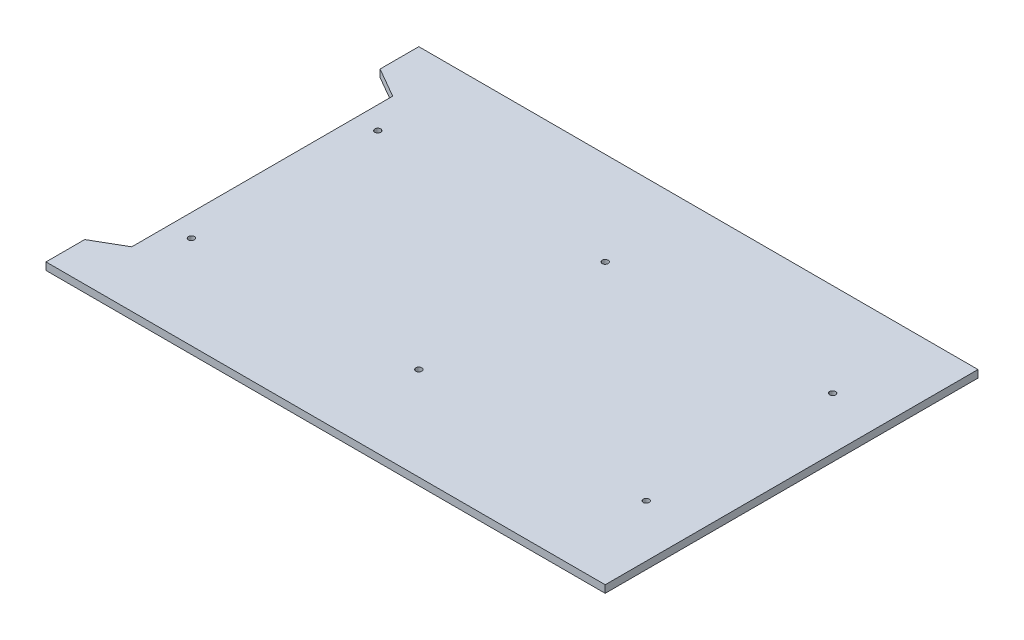
ISO-10303-21;
HEADER;
FILE_DESCRIPTION(('STEP AP214'),'2;1');
FILE_NAME('part.step','',(''),(''),'','','');
FILE_SCHEMA(('AUTOMOTIVE_DESIGN { 1 0 10303 214 1 1 1 1 }'));
ENDSEC;
DATA;
#1=APPLICATION_CONTEXT('core data for automotive mechanical design processes');
#2=APPLICATION_PROTOCOL_DEFINITION('international standard','automotive_design',2000,#1);
#3=PRODUCT_CONTEXT('',#1,'mechanical');
#4=PRODUCT('Part','Part','',(#3));
#5=PRODUCT_RELATED_PRODUCT_CATEGORY('part','',(#4));
#6=PRODUCT_DEFINITION_FORMATION('','',#4);
#7=PRODUCT_DEFINITION_CONTEXT('part definition',#1,'design');
#8=PRODUCT_DEFINITION('design','',#6,#7);
#9=PRODUCT_DEFINITION_SHAPE('','',#8);
#10=(LENGTH_UNIT() NAMED_UNIT(*) SI_UNIT(.MILLI.,.METRE.));
#11=(NAMED_UNIT(*) PLANE_ANGLE_UNIT() SI_UNIT($,.RADIAN.));
#12=(NAMED_UNIT(*) SI_UNIT($,.STERADIAN.) SOLID_ANGLE_UNIT());
#13=UNCERTAINTY_MEASURE_WITH_UNIT(LENGTH_MEASURE(1.E-05),#10,'distance_accuracy_value','');
#14=(GEOMETRIC_REPRESENTATION_CONTEXT(3) GLOBAL_UNCERTAINTY_ASSIGNED_CONTEXT((#13)) GLOBAL_UNIT_ASSIGNED_CONTEXT((#10,
#11,#12)) REPRESENTATION_CONTEXT('',''));
#15=CARTESIAN_POINT('',(0.,0.,0.));
#16=DIRECTION('',(0.,0.,1.));
#17=DIRECTION('',(1.,0.,0.));
#18=AXIS2_PLACEMENT_3D('',#15,#16,#17);
#19=CARTESIAN_POINT('',(-375.,10.,-250.));
#20=DIRECTION('',(1.,0.,0.));
#21=DIRECTION('',(0.,0.,-1.));
#22=AXIS2_PLACEMENT_3D('',#19,#20,#21);
#23=PLANE('',#22);
#24=DIRECTION('',(0.,0.,1.));
#25=VECTOR('',#24,1.);
#26=CARTESIAN_POINT('',(-375.,0.,-250.));
#27=LINE('',#26,#25);
#28=CARTESIAN_POINT('',(-375.,0.,-250.));
#29=VERTEX_POINT('',#28);
#30=CARTESIAN_POINT('',(-375.,0.,-198.094010767585));
#31=VERTEX_POINT('',#30);
#32=EDGE_CURVE('E133',#29,#31,#27,.T.);
#33=ORIENTED_EDGE('',*,*,#32,.T.);
#34=DIRECTION('',(0.,1.,0.));
#35=VECTOR('',#34,1.);
#36=CARTESIAN_POINT('',(-375.,-0.000999999999999265,-198.094010767585));
#37=LINE('',#36,#35);
#38=CARTESIAN_POINT('',(-375.,10.,-198.094010767585));
#39=VERTEX_POINT('',#38);
#40=EDGE_CURVE('E116',#31,#39,#37,.T.);
#41=ORIENTED_EDGE('',*,*,#40,.T.);
#42=DIRECTION('',(0.,0.,1.));
#43=VECTOR('',#42,1.);
#44=CARTESIAN_POINT('',(-375.,10.,-250.));
#45=LINE('',#44,#43);
#46=CARTESIAN_POINT('',(-375.,10.,-250.));
#47=VERTEX_POINT('',#46);
#48=EDGE_CURVE('E157',#47,#39,#45,.T.);
#49=ORIENTED_EDGE('',*,*,#48,.F.);
#50=DIRECTION('',(0.,-1.,0.));
#51=VECTOR('',#50,1.);
#52=CARTESIAN_POINT('',(-375.,10.,-250.));
#53=LINE('',#52,#51);
#54=EDGE_CURVE('E50',#47,#29,#53,.T.);
#55=ORIENTED_EDGE('',*,*,#54,.T.);
#56=EDGE_LOOP('',(#33,#41,#49,#55));
#57=FACE_BOUND('',#56,.T.);
#58=ADVANCED_FACE('F41',(#57),#23,.F.);
#59=CARTESIAN_POINT('',(375.,10.,-250.));
#60=DIRECTION('',(-1.,0.,0.));
#61=DIRECTION('',(0.,0.,1.));
#62=AXIS2_PLACEMENT_3D('',#59,#60,#61);
#63=PLANE('',#62);
#64=DIRECTION('',(0.,0.,-1.));
#65=VECTOR('',#64,1.);
#66=CARTESIAN_POINT('',(375.,0.,-250.));
#67=LINE('',#66,#65);
#68=CARTESIAN_POINT('',(375.,0.,250.));
#69=VERTEX_POINT('',#68);
#70=CARTESIAN_POINT('',(375.,0.,-250.));
#71=VERTEX_POINT('',#70);
#72=EDGE_CURVE('E171',#69,#71,#67,.T.);
#73=ORIENTED_EDGE('',*,*,#72,.T.);
#74=DIRECTION('',(0.,-1.,0.));
#75=VECTOR('',#74,1.);
#76=CARTESIAN_POINT('',(375.,10.,-250.));
#77=LINE('',#76,#75);
#78=CARTESIAN_POINT('',(375.,10.,-250.));
#79=VERTEX_POINT('',#78);
#80=EDGE_CURVE('E11',#79,#71,#77,.T.);
#81=ORIENTED_EDGE('',*,*,#80,.F.);
#82=DIRECTION('',(0.,0.,-1.));
#83=VECTOR('',#82,1.);
#84=CARTESIAN_POINT('',(375.,10.,-250.));
#85=LINE('',#84,#83);
#86=CARTESIAN_POINT('',(375.,10.,250.));
#87=VERTEX_POINT('',#86);
#88=EDGE_CURVE('E143',#87,#79,#85,.T.);
#89=ORIENTED_EDGE('',*,*,#88,.F.);
#90=DIRECTION('',(0.,-1.,0.));
#91=VECTOR('',#90,1.);
#92=CARTESIAN_POINT('',(375.,10.,250.));
#93=LINE('',#92,#91);
#94=EDGE_CURVE('E149',#87,#69,#93,.T.);
#95=ORIENTED_EDGE('',*,*,#94,.T.);
#96=EDGE_LOOP('',(#73,#81,#89,#95));
#97=FACE_BOUND('',#96,.T.);
#98=ADVANCED_FACE('F43',(#97),#63,.F.);
#99=CARTESIAN_POINT('',(-375.,10.,-250.));
#100=DIRECTION('',(0.,0.,1.));
#101=DIRECTION('',(1.,0.,0.));
#102=AXIS2_PLACEMENT_3D('',#99,#100,#101);
#103=PLANE('',#102);
#104=DIRECTION('',(-1.,0.,0.));
#105=VECTOR('',#104,1.);
#106=CARTESIAN_POINT('',(-375.,0.,-250.));
#107=LINE('',#106,#105);
#108=EDGE_CURVE('E145',#71,#29,#107,.T.);
#109=ORIENTED_EDGE('',*,*,#108,.T.);
#110=ORIENTED_EDGE('',*,*,#54,.F.);
#111=DIRECTION('',(-1.,0.,0.));
#112=VECTOR('',#111,1.);
#113=CARTESIAN_POINT('',(-375.,10.,-250.));
#114=LINE('',#113,#112);
#115=EDGE_CURVE('E94',#79,#47,#114,.T.);
#116=ORIENTED_EDGE('',*,*,#115,.F.);
#117=ORIENTED_EDGE('',*,*,#80,.T.);
#118=EDGE_LOOP('',(#109,#110,#116,#117));
#119=FACE_BOUND('',#118,.T.);
#120=ADVANCED_FACE('F255',(#119),#103,.F.);
#121=CARTESIAN_POINT('',(-375.,10.,198.094010767585));
#122=VERTEX_POINT('',#121);
#123=CARTESIAN_POINT('',(-375.,10.,250.));
#124=VERTEX_POINT('',#123);
#125=EDGE_CURVE('E160',#122,#124,#45,.T.);
#126=ORIENTED_EDGE('',*,*,#125,.F.);
#127=DIRECTION('',(0.,1.,0.));
#128=VECTOR('',#127,1.);
#129=CARTESIAN_POINT('',(-375.,-0.000999999999999265,198.094010767585));
#130=LINE('',#129,#128);
#131=CARTESIAN_POINT('',(-375.,0.,198.094010767585));
#132=VERTEX_POINT('',#131);
#133=EDGE_CURVE('E127',#132,#122,#130,.T.);
#134=ORIENTED_EDGE('',*,*,#133,.F.);
#135=CARTESIAN_POINT('',(-375.,0.,250.));
#136=VERTEX_POINT('',#135);
#137=EDGE_CURVE('E139',#132,#136,#27,.T.);
#138=ORIENTED_EDGE('',*,*,#137,.T.);
#139=DIRECTION('',(0.,-1.,0.));
#140=VECTOR('',#139,1.);
#141=CARTESIAN_POINT('',(-375.,10.,250.));
#142=LINE('',#141,#140);
#143=EDGE_CURVE('E152',#124,#136,#142,.T.);
#144=ORIENTED_EDGE('',*,*,#143,.F.);
#145=EDGE_LOOP('',(#126,#134,#138,#144));
#146=FACE_BOUND('',#145,.T.);
#147=ADVANCED_FACE('F253',(#146),#23,.F.);
#148=CARTESIAN_POINT('',(-375.,10.,250.));
#149=DIRECTION('',(0.,0.,-1.));
#150=DIRECTION('',(-1.,0.,0.));
#151=AXIS2_PLACEMENT_3D('',#148,#149,#150);
#152=PLANE('',#151);
#153=DIRECTION('',(1.,0.,0.));
#154=VECTOR('',#153,1.);
#155=CARTESIAN_POINT('',(-375.,0.,250.));
#156=LINE('',#155,#154);
#157=EDGE_CURVE('E87',#136,#69,#156,.T.);
#158=ORIENTED_EDGE('',*,*,#157,.T.);
#159=ORIENTED_EDGE('',*,*,#94,.F.);
#160=DIRECTION('',(1.,0.,0.));
#161=VECTOR('',#160,1.);
#162=CARTESIAN_POINT('',(-375.,10.,250.));
#163=LINE('',#162,#161);
#164=EDGE_CURVE('E66',#124,#87,#163,.T.);
#165=ORIENTED_EDGE('',*,*,#164,.F.);
#166=ORIENTED_EDGE('',*,*,#143,.T.);
#167=EDGE_LOOP('',(#158,#159,#165,#166));
#168=FACE_BOUND('',#167,.T.);
#169=ADVANCED_FACE('F256',(#168),#152,.F.);
#170=CARTESIAN_POINT('',(0.,10.,0.));
#171=DIRECTION('',(0.,1.,0.));
#172=DIRECTION('',(0.,0.,1.));
#173=AXIS2_PLACEMENT_3D('',#170,#171,#172);
#174=PLANE('',#173);
#175=DIRECTION('',(-0.866025403784436,0.,-0.500000000000004));
#176=VECTOR('',#175,1.);
#177=CARTESIAN_POINT('',(-335.,10.,-175.));
#178=LINE('',#177,#176);
#179=CARTESIAN_POINT('',(-335.,10.,-175.));
#180=VERTEX_POINT('',#179);
#181=EDGE_CURVE('E121',#180,#39,#178,.T.);
#182=ORIENTED_EDGE('',*,*,#181,.F.);
#183=DIRECTION('',(0.,0.,-1.));
#184=VECTOR('',#183,1.);
#185=CARTESIAN_POINT('',(-335.,10.,-175.));
#186=LINE('',#185,#184);
#187=CARTESIAN_POINT('',(-335.,10.,175.));
#188=VERTEX_POINT('',#187);
#189=EDGE_CURVE('E128',#188,#180,#186,.T.);
#190=ORIENTED_EDGE('',*,*,#189,.F.);
#191=DIRECTION('',(0.866025403784436,0.,-0.500000000000004));
#192=VECTOR('',#191,1.);
#193=CARTESIAN_POINT('',(-335.,10.,175.));
#194=LINE('',#193,#192);
#195=EDGE_CURVE('E236',#122,#188,#194,.T.);
#196=ORIENTED_EDGE('',*,*,#195,.F.);
#197=ORIENTED_EDGE('',*,*,#125,.T.);
#198=ORIENTED_EDGE('',*,*,#164,.T.);
#199=ORIENTED_EDGE('',*,*,#88,.T.);
#200=ORIENTED_EDGE('',*,*,#115,.T.);
#201=ORIENTED_EDGE('',*,*,#48,.T.);
#202=EDGE_LOOP('',(#182,#190,#196,#197,#198,#199,#200,#201));
#203=FACE_BOUND('',#202,.T.);
#204=CARTESIAN_POINT('',(-305.,10.,125.));
#205=DIRECTION('',(0.,1.,0.));
#206=DIRECTION('',(0.,0.,1.));
#207=AXIS2_PLACEMENT_3D('',#204,#205,#206);
#208=CIRCLE('',#207,3.99999999999999);
#209=CARTESIAN_POINT('',(-305.,10.,129.));
#210=VERTEX_POINT('',#209);
#211=EDGE_CURVE('E218',#210,#210,#208,.T.);
#212=ORIENTED_EDGE('',*,*,#211,.F.);
#213=EDGE_LOOP('',(#212));
#214=FACE_BOUND('',#213,.T.);
#215=CARTESIAN_POINT('',(-305.,10.,-125.));
#216=DIRECTION('',(0.,1.,0.));
#217=DIRECTION('',(0.,0.,1.));
#218=AXIS2_PLACEMENT_3D('',#215,#216,#217);
#219=CIRCLE('',#218,3.99999999999999);
#220=CARTESIAN_POINT('',(-305.,10.,-121.));
#221=VERTEX_POINT('',#220);
#222=EDGE_CURVE('E210',#221,#221,#219,.T.);
#223=ORIENTED_EDGE('',*,*,#222,.F.);
#224=EDGE_LOOP('',(#223));
#225=FACE_BOUND('',#224,.T.);
#226=CARTESIAN_POINT('',(0.,10.,125.));
#227=DIRECTION('',(0.,1.,0.));
#228=DIRECTION('',(0.,0.,1.));
#229=AXIS2_PLACEMENT_3D('',#226,#227,#228);
#230=CIRCLE('',#229,4.);
#231=CARTESIAN_POINT('',(0.,10.,129.));
#232=VERTEX_POINT('',#231);
#233=EDGE_CURVE('E202',#232,#232,#230,.T.);
#234=ORIENTED_EDGE('',*,*,#233,.F.);
#235=EDGE_LOOP('',(#234));
#236=FACE_BOUND('',#235,.T.);
#237=CARTESIAN_POINT('',(0.,10.,-125.));
#238=DIRECTION('',(0.,1.,0.));
#239=DIRECTION('',(0.,0.,1.));
#240=AXIS2_PLACEMENT_3D('',#237,#238,#239);
#241=CIRCLE('',#240,4.00000000000001);
#242=CARTESIAN_POINT('',(0.,10.,-121.));
#243=VERTEX_POINT('',#242);
#244=EDGE_CURVE('E194',#243,#243,#241,.T.);
#245=ORIENTED_EDGE('',*,*,#244,.F.);
#246=EDGE_LOOP('',(#245));
#247=FACE_BOUND('',#246,.T.);
#248=CARTESIAN_POINT('',(305.,10.,125.));
#249=DIRECTION('',(0.,1.,0.));
#250=DIRECTION('',(0.,0.,1.));
#251=AXIS2_PLACEMENT_3D('',#248,#249,#250);
#252=CIRCLE('',#251,3.99999999999999);
#253=CARTESIAN_POINT('',(305.,10.,129.));
#254=VERTEX_POINT('',#253);
#255=EDGE_CURVE('E186',#254,#254,#252,.T.);
#256=ORIENTED_EDGE('',*,*,#255,.F.);
#257=EDGE_LOOP('',(#256));
#258=FACE_BOUND('',#257,.T.);
#259=CARTESIAN_POINT('',(305.,10.,-125.));
#260=DIRECTION('',(0.,1.,0.));
#261=DIRECTION('',(0.,0.,1.));
#262=AXIS2_PLACEMENT_3D('',#259,#260,#261);
#263=CIRCLE('',#262,3.99999999999999);
#264=CARTESIAN_POINT('',(305.,10.,-121.));
#265=VERTEX_POINT('',#264);
#266=EDGE_CURVE('E169',#265,#265,#263,.T.);
#267=ORIENTED_EDGE('',*,*,#266,.F.);
#268=EDGE_LOOP('',(#267));
#269=FACE_BOUND('',#268,.T.);
#270=ADVANCED_FACE('F258',(#203,#214,#225,#236,#247,#258,#269),#174,.T.);
#271=CARTESIAN_POINT('',(0.,0.,0.));
#272=DIRECTION('',(0.,1.,0.));
#273=DIRECTION('',(0.,0.,1.));
#274=AXIS2_PLACEMENT_3D('',#271,#272,#273);
#275=PLANE('',#274);
#276=CARTESIAN_POINT('',(-305.,0.,125.));
#277=DIRECTION('',(0.,1.,0.));
#278=DIRECTION('',(0.,0.,1.));
#279=AXIS2_PLACEMENT_3D('',#276,#277,#278);
#280=CIRCLE('',#279,3.99999999999999);
#281=CARTESIAN_POINT('',(-305.,0.,129.));
#282=VERTEX_POINT('',#281);
#283=EDGE_CURVE('E214',#282,#282,#280,.T.);
#284=ORIENTED_EDGE('',*,*,#283,.T.);
#285=EDGE_LOOP('',(#284));
#286=FACE_BOUND('',#285,.T.);
#287=CARTESIAN_POINT('',(-305.,0.,-125.));
#288=DIRECTION('',(0.,1.,0.));
#289=DIRECTION('',(0.,0.,1.));
#290=AXIS2_PLACEMENT_3D('',#287,#288,#289);
#291=CIRCLE('',#290,3.99999999999999);
#292=CARTESIAN_POINT('',(-305.,0.,-121.));
#293=VERTEX_POINT('',#292);
#294=EDGE_CURVE('E206',#293,#293,#291,.T.);
#295=ORIENTED_EDGE('',*,*,#294,.T.);
#296=EDGE_LOOP('',(#295));
#297=FACE_BOUND('',#296,.T.);
#298=CARTESIAN_POINT('',(0.,0.,125.));
#299=DIRECTION('',(0.,1.,0.));
#300=DIRECTION('',(0.,0.,1.));
#301=AXIS2_PLACEMENT_3D('',#298,#299,#300);
#302=CIRCLE('',#301,4.);
#303=CARTESIAN_POINT('',(0.,0.,129.));
#304=VERTEX_POINT('',#303);
#305=EDGE_CURVE('E198',#304,#304,#302,.T.);
#306=ORIENTED_EDGE('',*,*,#305,.T.);
#307=EDGE_LOOP('',(#306));
#308=FACE_BOUND('',#307,.T.);
#309=CARTESIAN_POINT('',(0.,0.,-125.));
#310=DIRECTION('',(0.,1.,0.));
#311=DIRECTION('',(0.,0.,1.));
#312=AXIS2_PLACEMENT_3D('',#309,#310,#311);
#313=CIRCLE('',#312,4.00000000000001);
#314=CARTESIAN_POINT('',(0.,0.,-121.));
#315=VERTEX_POINT('',#314);
#316=EDGE_CURVE('E190',#315,#315,#313,.T.);
#317=ORIENTED_EDGE('',*,*,#316,.T.);
#318=EDGE_LOOP('',(#317));
#319=FACE_BOUND('',#318,.T.);
#320=CARTESIAN_POINT('',(305.,0.,125.));
#321=DIRECTION('',(0.,1.,0.));
#322=DIRECTION('',(0.,0.,1.));
#323=AXIS2_PLACEMENT_3D('',#320,#321,#322);
#324=CIRCLE('',#323,3.99999999999999);
#325=CARTESIAN_POINT('',(305.,0.,129.));
#326=VERTEX_POINT('',#325);
#327=EDGE_CURVE('E184',#326,#326,#324,.T.);
#328=ORIENTED_EDGE('',*,*,#327,.T.);
#329=EDGE_LOOP('',(#328));
#330=FACE_BOUND('',#329,.T.);
#331=CARTESIAN_POINT('',(305.,0.,-125.));
#332=DIRECTION('',(0.,1.,0.));
#333=DIRECTION('',(0.,0.,1.));
#334=AXIS2_PLACEMENT_3D('',#331,#332,#333);
#335=CIRCLE('',#334,3.99999999999999);
#336=CARTESIAN_POINT('',(305.,0.,-121.));
#337=VERTEX_POINT('',#336);
#338=EDGE_CURVE('E174',#337,#337,#335,.T.);
#339=ORIENTED_EDGE('',*,*,#338,.T.);
#340=EDGE_LOOP('',(#339));
#341=FACE_BOUND('',#340,.T.);
#342=DIRECTION('',(0.,0.,1.));
#343=VECTOR('',#342,1.);
#344=CARTESIAN_POINT('',(-335.,0.,-175.));
#345=LINE('',#344,#343);
#346=CARTESIAN_POINT('',(-335.,0.,-175.));
#347=VERTEX_POINT('',#346);
#348=CARTESIAN_POINT('',(-335.,0.,175.));
#349=VERTEX_POINT('',#348);
#350=EDGE_CURVE('E57',#347,#349,#345,.T.);
#351=ORIENTED_EDGE('',*,*,#350,.F.);
#352=DIRECTION('',(0.866025403784436,0.,0.500000000000004));
#353=VECTOR('',#352,1.);
#354=CARTESIAN_POINT('',(-335.,0.,-175.));
#355=LINE('',#354,#353);
#356=EDGE_CURVE('E119',#31,#347,#355,.T.);
#357=ORIENTED_EDGE('',*,*,#356,.F.);
#358=ORIENTED_EDGE('',*,*,#32,.F.);
#359=ORIENTED_EDGE('',*,*,#108,.F.);
#360=ORIENTED_EDGE('',*,*,#72,.F.);
#361=ORIENTED_EDGE('',*,*,#157,.F.);
#362=ORIENTED_EDGE('',*,*,#137,.F.);
#363=DIRECTION('',(-0.866025403784436,0.,0.500000000000004));
#364=VECTOR('',#363,1.);
#365=CARTESIAN_POINT('',(-335.,0.,175.));
#366=LINE('',#365,#364);
#367=EDGE_CURVE('E244',#349,#132,#366,.T.);
#368=ORIENTED_EDGE('',*,*,#367,.F.);
#369=EDGE_LOOP('',(#351,#357,#358,#359,#360,#361,#362,#368));
#370=FACE_BOUND('',#369,.T.);
#371=ADVANCED_FACE('F132',(#286,#297,#308,#319,#330,#341,#370),#275,.F.);
#372=CARTESIAN_POINT('',(305.,0.,-125.));
#373=DIRECTION('',(0.,1.,0.));
#374=DIRECTION('',(0.,0.,1.));
#375=AXIS2_PLACEMENT_3D('',#372,#373,#374);
#376=CYLINDRICAL_SURFACE('',#375,3.99999999999999);
#377=ORIENTED_EDGE('',*,*,#338,.F.);
#378=EDGE_LOOP('',(#377));
#379=FACE_BOUND('',#378,.T.);
#380=ORIENTED_EDGE('',*,*,#266,.T.);
#381=EDGE_LOOP('',(#380));
#382=FACE_BOUND('',#381,.T.);
#383=ADVANCED_FACE('F291',(#379,#382),#376,.F.);
#384=CARTESIAN_POINT('',(305.,0.,125.));
#385=DIRECTION('',(0.,1.,0.));
#386=DIRECTION('',(0.,0.,1.));
#387=AXIS2_PLACEMENT_3D('',#384,#385,#386);
#388=CYLINDRICAL_SURFACE('',#387,3.99999999999999);
#389=ORIENTED_EDGE('',*,*,#327,.F.);
#390=EDGE_LOOP('',(#389));
#391=FACE_BOUND('',#390,.T.);
#392=ORIENTED_EDGE('',*,*,#255,.T.);
#393=EDGE_LOOP('',(#392));
#394=FACE_BOUND('',#393,.T.);
#395=ADVANCED_FACE('F345',(#391,#394),#388,.F.);
#396=CARTESIAN_POINT('',(0.,0.,-125.));
#397=DIRECTION('',(0.,1.,0.));
#398=DIRECTION('',(0.,0.,1.));
#399=AXIS2_PLACEMENT_3D('',#396,#397,#398);
#400=CYLINDRICAL_SURFACE('',#399,4.00000000000001);
#401=ORIENTED_EDGE('',*,*,#316,.F.);
#402=EDGE_LOOP('',(#401));
#403=FACE_BOUND('',#402,.T.);
#404=ORIENTED_EDGE('',*,*,#244,.T.);
#405=EDGE_LOOP('',(#404));
#406=FACE_BOUND('',#405,.T.);
#407=ADVANCED_FACE('F335',(#403,#406),#400,.F.);
#408=CARTESIAN_POINT('',(0.,0.,125.));
#409=DIRECTION('',(0.,1.,0.));
#410=DIRECTION('',(0.,0.,1.));
#411=AXIS2_PLACEMENT_3D('',#408,#409,#410);
#412=CYLINDRICAL_SURFACE('',#411,4.);
#413=ORIENTED_EDGE('',*,*,#305,.F.);
#414=EDGE_LOOP('',(#413));
#415=FACE_BOUND('',#414,.T.);
#416=ORIENTED_EDGE('',*,*,#233,.T.);
#417=EDGE_LOOP('',(#416));
#418=FACE_BOUND('',#417,.T.);
#419=ADVANCED_FACE('F325',(#415,#418),#412,.F.);
#420=CARTESIAN_POINT('',(-305.,0.,-125.));
#421=DIRECTION('',(0.,1.,0.));
#422=DIRECTION('',(0.,0.,1.));
#423=AXIS2_PLACEMENT_3D('',#420,#421,#422);
#424=CYLINDRICAL_SURFACE('',#423,3.99999999999999);
#425=ORIENTED_EDGE('',*,*,#294,.F.);
#426=EDGE_LOOP('',(#425));
#427=FACE_BOUND('',#426,.T.);
#428=ORIENTED_EDGE('',*,*,#222,.T.);
#429=EDGE_LOOP('',(#428));
#430=FACE_BOUND('',#429,.T.);
#431=ADVANCED_FACE('F314',(#427,#430),#424,.F.);
#432=CARTESIAN_POINT('',(-305.,0.,125.));
#433=DIRECTION('',(0.,1.,0.));
#434=DIRECTION('',(0.,0.,1.));
#435=AXIS2_PLACEMENT_3D('',#432,#433,#434);
#436=CYLINDRICAL_SURFACE('',#435,3.99999999999999);
#437=ORIENTED_EDGE('',*,*,#283,.F.);
#438=EDGE_LOOP('',(#437));
#439=FACE_BOUND('',#438,.T.);
#440=ORIENTED_EDGE('',*,*,#211,.T.);
#441=EDGE_LOOP('',(#440));
#442=FACE_BOUND('',#441,.T.);
#443=ADVANCED_FACE('F310',(#439,#442),#436,.F.);
#444=CARTESIAN_POINT('',(-335.,-0.000999999999999265,-175.));
#445=DIRECTION('',(0.500000000000004,0.,-0.866025403784436));
#446=DIRECTION('',(-0.866025403784436,0.,-0.500000000000004));
#447=AXIS2_PLACEMENT_3D('',#444,#445,#446);
#448=PLANE('',#447);
#449=ORIENTED_EDGE('',*,*,#356,.T.);
#450=DIRECTION('',(0.,1.,0.));
#451=VECTOR('',#450,1.);
#452=CARTESIAN_POINT('',(-335.,-0.000999999999999265,-175.));
#453=LINE('',#452,#451);
#454=EDGE_CURVE('E222',#347,#180,#453,.T.);
#455=ORIENTED_EDGE('',*,*,#454,.T.);
#456=ORIENTED_EDGE('',*,*,#181,.T.);
#457=ORIENTED_EDGE('',*,*,#40,.F.);
#458=EDGE_LOOP('',(#449,#455,#456,#457));
#459=FACE_BOUND('',#458,.T.);
#460=ADVANCED_FACE('F118',(#459),#448,.F.);
#461=CARTESIAN_POINT('',(-335.,-0.000999999999999265,-175.));
#462=DIRECTION('',(1.,0.,0.));
#463=DIRECTION('',(0.,0.,-1.));
#464=AXIS2_PLACEMENT_3D('',#461,#462,#463);
#465=PLANE('',#464);
#466=ORIENTED_EDGE('',*,*,#350,.T.);
#467=DIRECTION('',(0.,1.,0.));
#468=VECTOR('',#467,1.);
#469=CARTESIAN_POINT('',(-335.,-0.000999999999999265,175.));
#470=LINE('',#469,#468);
#471=EDGE_CURVE('E228',#349,#188,#470,.T.);
#472=ORIENTED_EDGE('',*,*,#471,.T.);
#473=ORIENTED_EDGE('',*,*,#189,.T.);
#474=ORIENTED_EDGE('',*,*,#454,.F.);
#475=EDGE_LOOP('',(#466,#472,#473,#474));
#476=FACE_BOUND('',#475,.T.);
#477=ADVANCED_FACE('F405',(#476),#465,.F.);
#478=CARTESIAN_POINT('',(-335.,-0.000999999999999265,175.));
#479=DIRECTION('',(0.500000000000004,0.,0.866025403784436));
#480=DIRECTION('',(0.866025403784436,0.,-0.500000000000004));
#481=AXIS2_PLACEMENT_3D('',#478,#479,#480);
#482=PLANE('',#481);
#483=ORIENTED_EDGE('',*,*,#367,.T.);
#484=ORIENTED_EDGE('',*,*,#133,.T.);
#485=ORIENTED_EDGE('',*,*,#195,.T.);
#486=ORIENTED_EDGE('',*,*,#471,.F.);
#487=EDGE_LOOP('',(#483,#484,#485,#486));
#488=FACE_BOUND('',#487,.T.);
#489=ADVANCED_FACE('F248',(#488),#482,.F.);
#490=CLOSED_SHELL('',(#58,#98,#120,#147,#169,#270,#371,#383,#395,#407,#419,#431,#443,#460,#477,#489));
#491=MANIFOLD_SOLID_BREP('B2',#490);
#492=ADVANCED_BREP_SHAPE_REPRESENTATION('',(#18,#491),#14);
#493=SHAPE_DEFINITION_REPRESENTATION(#9,#492);
ENDSEC;
END-ISO-10303-21;
